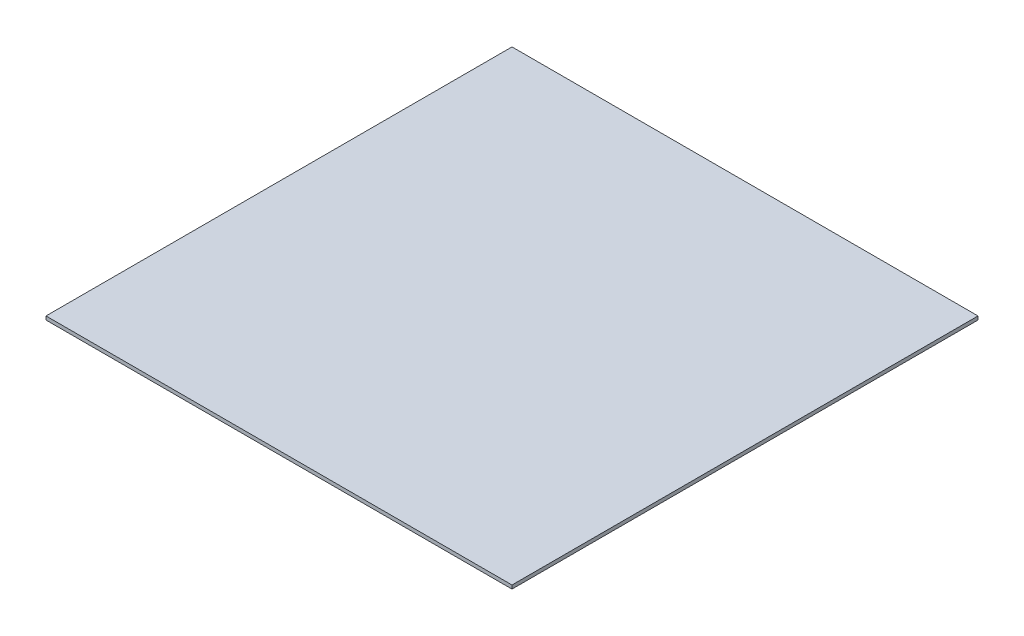
ISO-10303-21;
HEADER;
FILE_DESCRIPTION(('STEP AP214'),'2;1');
FILE_NAME('part.step','',(''),(''),'','','');
FILE_SCHEMA(('AUTOMOTIVE_DESIGN { 1 0 10303 214 1 1 1 1 }'));
ENDSEC;
DATA;
#1=APPLICATION_CONTEXT('core data for automotive mechanical design processes');
#2=APPLICATION_PROTOCOL_DEFINITION('international standard','automotive_design',2000,#1);
#3=PRODUCT_CONTEXT('',#1,'mechanical');
#4=PRODUCT('Part','Part','',(#3));
#5=PRODUCT_RELATED_PRODUCT_CATEGORY('part','',(#4));
#6=PRODUCT_DEFINITION_FORMATION('','',#4);
#7=PRODUCT_DEFINITION_CONTEXT('part definition',#1,'design');
#8=PRODUCT_DEFINITION('design','',#6,#7);
#9=PRODUCT_DEFINITION_SHAPE('','',#8);
#10=(LENGTH_UNIT() NAMED_UNIT(*) SI_UNIT(.MILLI.,.METRE.));
#11=(NAMED_UNIT(*) PLANE_ANGLE_UNIT() SI_UNIT($,.RADIAN.));
#12=(NAMED_UNIT(*) SI_UNIT($,.STERADIAN.) SOLID_ANGLE_UNIT());
#13=UNCERTAINTY_MEASURE_WITH_UNIT(LENGTH_MEASURE(1.E-05),#10,'distance_accuracy_value','');
#14=(GEOMETRIC_REPRESENTATION_CONTEXT(3) GLOBAL_UNCERTAINTY_ASSIGNED_CONTEXT((#13)) GLOBAL_UNIT_ASSIGNED_CONTEXT((#10,
#11,#12)) REPRESENTATION_CONTEXT('',''));
#15=CARTESIAN_POINT('',(0.,0.,0.));
#16=DIRECTION('',(0.,0.,1.));
#17=DIRECTION('',(1.,0.,0.));
#18=AXIS2_PLACEMENT_3D('',#15,#16,#17);
#19=CARTESIAN_POINT('',(-47.0316881728543,1.,-81.8994098232172));
#20=DIRECTION('',(1.,0.,0.));
#21=DIRECTION('',(0.,0.,-1.));
#22=AXIS2_PLACEMENT_3D('',#19,#20,#21);
#23=PLANE('',#22);
#24=DIRECTION('',(0.,0.,1.));
#25=VECTOR('',#24,1.);
#26=CARTESIAN_POINT('',(-47.0316881728543,0.,-81.8994098232172));
#27=LINE('',#26,#25);
#28=CARTESIAN_POINT('',(-47.0316881728543,0.,-81.8994098232172));
#29=VERTEX_POINT('',#28);
#30=CARTESIAN_POINT('',(-47.0316881728543,0.,48.1005901767828));
#31=VERTEX_POINT('',#30);
#32=EDGE_CURVE('E95',#29,#31,#27,.T.);
#33=ORIENTED_EDGE('',*,*,#32,.T.);
#34=DIRECTION('',(0.,-1.,0.));
#35=VECTOR('',#34,1.);
#36=CARTESIAN_POINT('',(-47.0316881728543,1.,48.1005901767828));
#37=LINE('',#36,#35);
#38=CARTESIAN_POINT('',(-47.0316881728543,1.,48.1005901767828));
#39=VERTEX_POINT('',#38);
#40=EDGE_CURVE('E11',#39,#31,#37,.T.);
#41=ORIENTED_EDGE('',*,*,#40,.F.);
#42=DIRECTION('',(0.,0.,1.));
#43=VECTOR('',#42,1.);
#44=CARTESIAN_POINT('',(-47.0316881728543,1.,-81.8994098232172));
#45=LINE('',#44,#43);
#46=CARTESIAN_POINT('',(-47.0316881728543,1.,-81.8994098232172));
#47=VERTEX_POINT('',#46);
#48=EDGE_CURVE('E83',#47,#39,#45,.T.);
#49=ORIENTED_EDGE('',*,*,#48,.F.);
#50=DIRECTION('',(0.,-1.,0.));
#51=VECTOR('',#50,1.);
#52=CARTESIAN_POINT('',(-47.0316881728543,1.,-81.8994098232172));
#53=LINE('',#52,#51);
#54=EDGE_CURVE('E91',#47,#29,#53,.T.);
#55=ORIENTED_EDGE('',*,*,#54,.T.);
#56=EDGE_LOOP('',(#33,#41,#49,#55));
#57=FACE_BOUND('',#56,.T.);
#58=ADVANCED_FACE('F32',(#57),#23,.F.);
#59=CARTESIAN_POINT('',(-47.0316881728543,1.,48.1005901767828));
#60=DIRECTION('',(0.,0.,-1.));
#61=DIRECTION('',(-1.,0.,0.));
#62=AXIS2_PLACEMENT_3D('',#59,#60,#61);
#63=PLANE('',#62);
#64=DIRECTION('',(1.,0.,0.));
#65=VECTOR('',#64,1.);
#66=CARTESIAN_POINT('',(-47.0316881728543,0.,48.1005901767828));
#67=LINE('',#66,#65);
#68=CARTESIAN_POINT('',(82.9683118271458,0.,48.1005901767828));
#69=VERTEX_POINT('',#68);
#70=EDGE_CURVE('E87',#31,#69,#67,.T.);
#71=ORIENTED_EDGE('',*,*,#70,.T.);
#72=DIRECTION('',(0.,-1.,0.));
#73=VECTOR('',#72,1.);
#74=CARTESIAN_POINT('',(82.9683118271458,1.,48.1005901767828));
#75=LINE('',#74,#73);
#76=CARTESIAN_POINT('',(82.9683118271458,1.,48.1005901767828));
#77=VERTEX_POINT('',#76);
#78=EDGE_CURVE('E40',#77,#69,#75,.T.);
#79=ORIENTED_EDGE('',*,*,#78,.F.);
#80=DIRECTION('',(1.,0.,0.));
#81=VECTOR('',#80,1.);
#82=CARTESIAN_POINT('',(-47.0316881728543,1.,48.1005901767828));
#83=LINE('',#82,#81);
#84=EDGE_CURVE('E78',#39,#77,#83,.T.);
#85=ORIENTED_EDGE('',*,*,#84,.F.);
#86=ORIENTED_EDGE('',*,*,#40,.T.);
#87=EDGE_LOOP('',(#71,#79,#85,#86));
#88=FACE_BOUND('',#87,.T.);
#89=ADVANCED_FACE('F86',(#88),#63,.F.);
#90=CARTESIAN_POINT('',(82.9683118271457,1.,-81.8994098232173));
#91=DIRECTION('',(-1.,0.,0.));
#92=DIRECTION('',(0.,0.,1.));
#93=AXIS2_PLACEMENT_3D('',#90,#91,#92);
#94=PLANE('',#93);
#95=DIRECTION('',(0.,0.,-1.));
#96=VECTOR('',#95,1.);
#97=CARTESIAN_POINT('',(82.9683118271457,0.,-81.8994098232173));
#98=LINE('',#97,#96);
#99=CARTESIAN_POINT('',(82.9683118271457,0.,-81.8994098232173));
#100=VERTEX_POINT('',#99);
#101=EDGE_CURVE('E65',#69,#100,#98,.T.);
#102=ORIENTED_EDGE('',*,*,#101,.T.);
#103=DIRECTION('',(0.,-1.,0.));
#104=VECTOR('',#103,1.);
#105=CARTESIAN_POINT('',(82.9683118271457,1.,-81.8994098232173));
#106=LINE('',#105,#104);
#107=CARTESIAN_POINT('',(82.9683118271457,1.,-81.8994098232173));
#108=VERTEX_POINT('',#107);
#109=EDGE_CURVE('E88',#108,#100,#106,.T.);
#110=ORIENTED_EDGE('',*,*,#109,.F.);
#111=DIRECTION('',(0.,0.,-1.));
#112=VECTOR('',#111,1.);
#113=CARTESIAN_POINT('',(82.9683118271457,1.,-81.8994098232173));
#114=LINE('',#113,#112);
#115=EDGE_CURVE('E81',#77,#108,#114,.T.);
#116=ORIENTED_EDGE('',*,*,#115,.F.);
#117=ORIENTED_EDGE('',*,*,#78,.T.);
#118=EDGE_LOOP('',(#102,#110,#116,#117));
#119=FACE_BOUND('',#118,.T.);
#120=ADVANCED_FACE('F89',(#119),#94,.F.);
#121=CARTESIAN_POINT('',(-47.0316881728543,1.,-81.8994098232172));
#122=DIRECTION('',(0.,0.,1.));
#123=DIRECTION('',(1.,0.,0.));
#124=AXIS2_PLACEMENT_3D('',#121,#122,#123);
#125=PLANE('',#124);
#126=DIRECTION('',(-1.,0.,0.));
#127=VECTOR('',#126,1.);
#128=CARTESIAN_POINT('',(-47.0316881728543,0.,-81.8994098232172));
#129=LINE('',#128,#127);
#130=EDGE_CURVE('E71',#100,#29,#129,.T.);
#131=ORIENTED_EDGE('',*,*,#130,.T.);
#132=ORIENTED_EDGE('',*,*,#54,.F.);
#133=DIRECTION('',(-1.,0.,0.));
#134=VECTOR('',#133,1.);
#135=CARTESIAN_POINT('',(-47.0316881728543,1.,-81.8994098232172));
#136=LINE('',#135,#134);
#137=EDGE_CURVE('E48',#108,#47,#136,.T.);
#138=ORIENTED_EDGE('',*,*,#137,.F.);
#139=ORIENTED_EDGE('',*,*,#109,.T.);
#140=EDGE_LOOP('',(#131,#132,#138,#139));
#141=FACE_BOUND('',#140,.T.);
#142=ADVANCED_FACE('F102',(#141),#125,.F.);
#143=CARTESIAN_POINT('',(-47.0316881728543,1.,48.1005901767828));
#144=DIRECTION('',(0.,1.,0.));
#145=DIRECTION('',(0.,0.,1.));
#146=AXIS2_PLACEMENT_3D('',#143,#144,#145);
#147=PLANE('',#146);
#148=ORIENTED_EDGE('',*,*,#48,.T.);
#149=ORIENTED_EDGE('',*,*,#84,.T.);
#150=ORIENTED_EDGE('',*,*,#115,.T.);
#151=ORIENTED_EDGE('',*,*,#137,.T.);
#152=EDGE_LOOP('',(#148,#149,#150,#151));
#153=FACE_BOUND('',#152,.T.);
#154=ADVANCED_FACE('F79',(#153),#147,.T.);
#155=CARTESIAN_POINT('',(-47.0316881728543,0.,48.1005901767828));
#156=DIRECTION('',(0.,1.,0.));
#157=DIRECTION('',(0.,0.,1.));
#158=AXIS2_PLACEMENT_3D('',#155,#156,#157);
#159=PLANE('',#158);
#160=ORIENTED_EDGE('',*,*,#32,.F.);
#161=ORIENTED_EDGE('',*,*,#130,.F.);
#162=ORIENTED_EDGE('',*,*,#101,.F.);
#163=ORIENTED_EDGE('',*,*,#70,.F.);
#164=EDGE_LOOP('',(#160,#161,#162,#163));
#165=FACE_BOUND('',#164,.T.);
#166=ADVANCED_FACE('F105',(#165),#159,.F.);
#167=CLOSED_SHELL('',(#58,#89,#120,#142,#154,#166));
#168=MANIFOLD_SOLID_BREP('B2',#167);
#169=ADVANCED_BREP_SHAPE_REPRESENTATION('',(#18,#168),#14);
#170=SHAPE_DEFINITION_REPRESENTATION(#9,#169);
ENDSEC;
END-ISO-10303-21;
